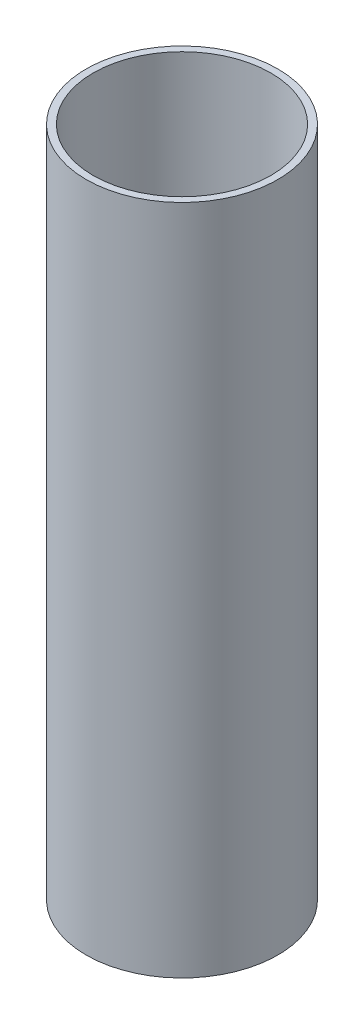
ISO-10303-21;
HEADER;
FILE_DESCRIPTION(('STEP AP214'),'2;1');
FILE_NAME('part.step','',(''),(''),'','','');
FILE_SCHEMA(('AUTOMOTIVE_DESIGN { 1 0 10303 214 1 1 1 1 }'));
ENDSEC;
DATA;
#1=APPLICATION_CONTEXT('core data for automotive mechanical design processes');
#2=APPLICATION_PROTOCOL_DEFINITION('international standard','automotive_design',2000,#1);
#3=PRODUCT_CONTEXT('',#1,'mechanical');
#4=PRODUCT('Part','Part','',(#3));
#5=PRODUCT_RELATED_PRODUCT_CATEGORY('part','',(#4));
#6=PRODUCT_DEFINITION_FORMATION('','',#4);
#7=PRODUCT_DEFINITION_CONTEXT('part definition',#1,'design');
#8=PRODUCT_DEFINITION('design','',#6,#7);
#9=PRODUCT_DEFINITION_SHAPE('','',#8);
#10=(LENGTH_UNIT() NAMED_UNIT(*) SI_UNIT(.MILLI.,.METRE.));
#11=(NAMED_UNIT(*) PLANE_ANGLE_UNIT() SI_UNIT($,.RADIAN.));
#12=(NAMED_UNIT(*) SI_UNIT($,.STERADIAN.) SOLID_ANGLE_UNIT());
#13=UNCERTAINTY_MEASURE_WITH_UNIT(LENGTH_MEASURE(1.E-05),#10,'distance_accuracy_value','');
#14=(GEOMETRIC_REPRESENTATION_CONTEXT(3) GLOBAL_UNCERTAINTY_ASSIGNED_CONTEXT((#13)) GLOBAL_UNIT_ASSIGNED_CONTEXT((#10,
#11,#12)) REPRESENTATION_CONTEXT('',''));
#15=CARTESIAN_POINT('',(0.,0.,0.));
#16=DIRECTION('',(0.,0.,1.));
#17=DIRECTION('',(1.,0.,0.));
#18=AXIS2_PLACEMENT_3D('',#15,#16,#17);
#19=CARTESIAN_POINT('',(0.,177.66,0.));
#20=DIRECTION('',(0.,1.,0.));
#21=DIRECTION('',(0.,0.,1.));
#22=AXIS2_PLACEMENT_3D('',#19,#20,#21);
#23=PLANE('',#22);
#24=CARTESIAN_POINT('',(0.,177.66,0.));
#25=DIRECTION('',(0.,1.,0.));
#26=DIRECTION('',(0.,0.,1.));
#27=AXIS2_PLACEMENT_3D('',#24,#25,#26);
#28=CIRCLE('',#27,25.35);
#29=CARTESIAN_POINT('',(0.,177.66,25.35));
#30=VERTEX_POINT('',#29);
#31=EDGE_CURVE('E10',#30,#30,#28,.T.);
#32=ORIENTED_EDGE('',*,*,#31,.T.);
#33=EDGE_LOOP('',(#32));
#34=FACE_BOUND('',#33,.T.);
#35=CARTESIAN_POINT('',(0.,177.66,0.));
#36=DIRECTION('',(0.,1.,0.));
#37=DIRECTION('',(0.,0.,1.));
#38=AXIS2_PLACEMENT_3D('',#35,#36,#37);
#39=CIRCLE('',#38,23.5);
#40=CARTESIAN_POINT('',(0.,177.66,23.5));
#41=VERTEX_POINT('',#40);
#42=EDGE_CURVE('E50',#41,#41,#39,.T.);
#43=ORIENTED_EDGE('',*,*,#42,.F.);
#44=EDGE_LOOP('',(#43));
#45=FACE_BOUND('',#44,.T.);
#46=ADVANCED_FACE('F37',(#34,#45),#23,.T.);
#47=CARTESIAN_POINT('',(0.,0.,0.));
#48=DIRECTION('',(0.,1.,0.));
#49=DIRECTION('',(0.,0.,1.));
#50=AXIS2_PLACEMENT_3D('',#47,#48,#49);
#51=PLANE('',#50);
#52=CARTESIAN_POINT('',(0.,0.,0.));
#53=DIRECTION('',(0.,1.,0.));
#54=DIRECTION('',(0.,0.,1.));
#55=AXIS2_PLACEMENT_3D('',#52,#53,#54);
#56=CIRCLE('',#55,25.35);
#57=CARTESIAN_POINT('',(0.,0.,25.35));
#58=VERTEX_POINT('',#57);
#59=EDGE_CURVE('E41',#58,#58,#56,.T.);
#60=ORIENTED_EDGE('',*,*,#59,.F.);
#61=EDGE_LOOP('',(#60));
#62=FACE_BOUND('',#61,.T.);
#63=CARTESIAN_POINT('',(0.,0.,0.));
#64=DIRECTION('',(0.,1.,0.));
#65=DIRECTION('',(0.,0.,1.));
#66=AXIS2_PLACEMENT_3D('',#63,#64,#65);
#67=CIRCLE('',#66,23.5);
#68=CARTESIAN_POINT('',(0.,0.,23.5));
#69=VERTEX_POINT('',#68);
#70=EDGE_CURVE('E52',#69,#69,#67,.T.);
#71=ORIENTED_EDGE('',*,*,#70,.T.);
#72=EDGE_LOOP('',(#71));
#73=FACE_BOUND('',#72,.T.);
#74=ADVANCED_FACE('F64',(#62,#73),#51,.F.);
#75=CARTESIAN_POINT('',(0.,177.66,0.));
#76=DIRECTION('',(0.,-1.,0.));
#77=DIRECTION('',(0.,0.,-1.));
#78=AXIS2_PLACEMENT_3D('',#75,#76,#77);
#79=CYLINDRICAL_SURFACE('',#78,25.35);
#80=ORIENTED_EDGE('',*,*,#31,.F.);
#81=EDGE_LOOP('',(#80));
#82=FACE_BOUND('',#81,.T.);
#83=ORIENTED_EDGE('',*,*,#59,.T.);
#84=EDGE_LOOP('',(#83));
#85=FACE_BOUND('',#84,.T.);
#86=ADVANCED_FACE('F39',(#82,#85),#79,.T.);
#87=CARTESIAN_POINT('',(0.,177.66,0.));
#88=DIRECTION('',(0.,-1.,0.));
#89=DIRECTION('',(0.,0.,-1.));
#90=AXIS2_PLACEMENT_3D('',#87,#88,#89);
#91=CYLINDRICAL_SURFACE('',#90,23.5);
#92=ORIENTED_EDGE('',*,*,#42,.T.);
#93=EDGE_LOOP('',(#92));
#94=FACE_BOUND('',#93,.T.);
#95=ORIENTED_EDGE('',*,*,#70,.F.);
#96=EDGE_LOOP('',(#95));
#97=FACE_BOUND('',#96,.T.);
#98=ADVANCED_FACE('F60',(#94,#97),#91,.F.);
#99=CLOSED_SHELL('',(#46,#74,#86,#98));
#100=MANIFOLD_SOLID_BREP('B2',#99);
#101=ADVANCED_BREP_SHAPE_REPRESENTATION('',(#18,#100),#14);
#102=SHAPE_DEFINITION_REPRESENTATION(#9,#101);
ENDSEC;
END-ISO-10303-21;
